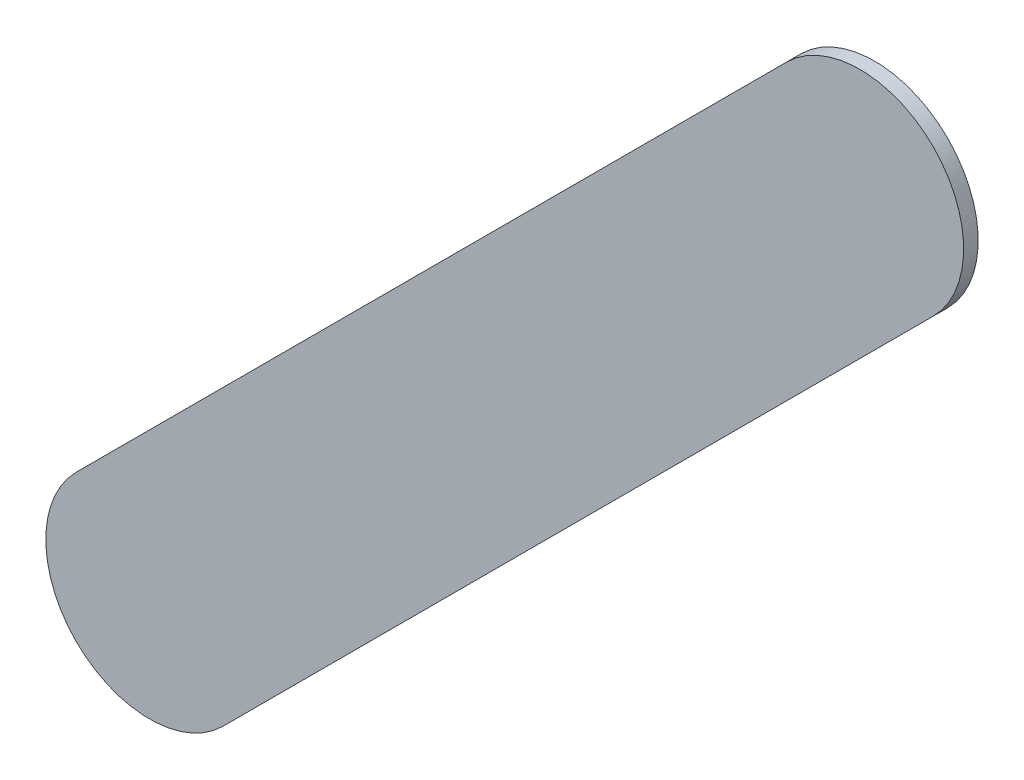
ISO-10303-21;
HEADER;
FILE_DESCRIPTION(('STEP AP214'),'2;1');
FILE_NAME('part.step','',(''),(''),'','','');
FILE_SCHEMA(('AUTOMOTIVE_DESIGN { 1 0 10303 214 1 1 1 1 }'));
ENDSEC;
DATA;
#1=APPLICATION_CONTEXT('core data for automotive mechanical design processes');
#2=APPLICATION_PROTOCOL_DEFINITION('international standard','automotive_design',2000,#1);
#3=PRODUCT_CONTEXT('',#1,'mechanical');
#4=PRODUCT('Part','Part','',(#3));
#5=PRODUCT_RELATED_PRODUCT_CATEGORY('part','',(#4));
#6=PRODUCT_DEFINITION_FORMATION('','',#4);
#7=PRODUCT_DEFINITION_CONTEXT('part definition',#1,'design');
#8=PRODUCT_DEFINITION('design','',#6,#7);
#9=PRODUCT_DEFINITION_SHAPE('','',#8);
#10=(LENGTH_UNIT() NAMED_UNIT(*) SI_UNIT(.MILLI.,.METRE.));
#11=(NAMED_UNIT(*) PLANE_ANGLE_UNIT() SI_UNIT($,.RADIAN.));
#12=(NAMED_UNIT(*) SI_UNIT($,.STERADIAN.) SOLID_ANGLE_UNIT());
#13=UNCERTAINTY_MEASURE_WITH_UNIT(LENGTH_MEASURE(1.E-05),#10,'distance_accuracy_value','');
#14=(GEOMETRIC_REPRESENTATION_CONTEXT(3) GLOBAL_UNCERTAINTY_ASSIGNED_CONTEXT((#13)) GLOBAL_UNIT_ASSIGNED_CONTEXT((#10,
#11,#12)) REPRESENTATION_CONTEXT('',''));
#15=CARTESIAN_POINT('',(0.,0.,0.));
#16=DIRECTION('',(0.,0.,1.));
#17=DIRECTION('',(1.,0.,0.));
#18=AXIS2_PLACEMENT_3D('',#15,#16,#17);
#19=CARTESIAN_POINT('',(129.528776,-109.076776,0.));
#20=DIRECTION('',(0.,0.,1.));
#21=DIRECTION('',(1.,0.,0.));
#22=AXIS2_PLACEMENT_3D('',#19,#20,#21);
#23=PLANE('',#22);
#24=DIRECTION('',(0.707106781186548,0.707106781186548,0.));
#25=VECTOR('',#24,1.);
#26=CARTESIAN_POINT('',(129.528776,-109.076776,0.));
#27=LINE('',#26,#25);
#28=CARTESIAN_POINT('',(129.528776,-109.076776,0.));
#29=VERTEX_POINT('',#28);
#30=CARTESIAN_POINT('',(131.240776,-107.364776,0.));
#31=VERTEX_POINT('',#30);
#32=EDGE_CURVE('E80',#29,#31,#27,.T.);
#33=ORIENTED_EDGE('',*,*,#32,.T.);
#34=CARTESIAN_POINT('',(131.0639995,-107.1879995,0.));
#35=DIRECTION('',(0.,0.,1.));
#36=DIRECTION('',(0.707106781186548,-0.707106781186548,0.));
#37=AXIS2_PLACEMENT_3D('',#34,#35,#36);
#38=CIRCLE('',#37,0.249999723809);
#39=CARTESIAN_POINT('',(130.887223,-107.011223,0.));
#40=VERTEX_POINT('',#39);
#41=EDGE_CURVE('E97',#31,#40,#38,.T.);
#42=ORIENTED_EDGE('',*,*,#41,.T.);
#43=DIRECTION('',(-0.707106781186548,-0.707106781186548,0.));
#44=VECTOR('',#43,1.);
#45=CARTESIAN_POINT('',(130.887223,-107.011223,0.));
#46=LINE('',#45,#44);
#47=CARTESIAN_POINT('',(129.175223,-108.723223,0.));
#48=VERTEX_POINT('',#47);
#49=EDGE_CURVE('E20',#40,#48,#46,.T.);
#50=ORIENTED_EDGE('',*,*,#49,.T.);
#51=CARTESIAN_POINT('',(129.3519995,-108.8999995,0.));
#52=DIRECTION('',(0.,0.,1.));
#53=DIRECTION('',(-0.707106781186548,0.707106781186548,0.));
#54=AXIS2_PLACEMENT_3D('',#51,#52,#53);
#55=CIRCLE('',#54,0.249999723809);
#56=EDGE_CURVE('E11',#48,#29,#55,.T.);
#57=ORIENTED_EDGE('',*,*,#56,.T.);
#58=EDGE_LOOP('',(#33,#42,#50,#57));
#59=FACE_BOUND('',#58,.T.);
#60=ADVANCED_FACE('F17',(#59),#23,.T.);
#61=CARTESIAN_POINT('',(129.528776,-109.076776,-0.035));
#62=DIRECTION('',(0.,0.,1.));
#63=DIRECTION('',(1.,0.,0.));
#64=AXIS2_PLACEMENT_3D('',#61,#62,#63);
#65=PLANE('',#64);
#66=CARTESIAN_POINT('',(129.3519995,-108.8999995,-0.035));
#67=DIRECTION('',(0.,0.,1.));
#68=DIRECTION('',(-0.707106781186548,0.707106781186548,0.));
#69=AXIS2_PLACEMENT_3D('',#66,#67,#68);
#70=CIRCLE('',#69,0.249999723809);
#71=CARTESIAN_POINT('',(129.175223,-108.723223,-0.035));
#72=VERTEX_POINT('',#71);
#73=CARTESIAN_POINT('',(129.528776,-109.076776,-0.035));
#74=VERTEX_POINT('',#73);
#75=EDGE_CURVE('E27',#72,#74,#70,.T.);
#76=ORIENTED_EDGE('',*,*,#75,.F.);
#77=DIRECTION('',(-0.707106781186548,-0.707106781186548,0.));
#78=VECTOR('',#77,1.);
#79=CARTESIAN_POINT('',(130.887223,-107.011223,-0.035));
#80=LINE('',#79,#78);
#81=CARTESIAN_POINT('',(130.887223,-107.011223,-0.035));
#82=VERTEX_POINT('',#81);
#83=EDGE_CURVE('E106',#82,#72,#80,.T.);
#84=ORIENTED_EDGE('',*,*,#83,.F.);
#85=CARTESIAN_POINT('',(131.0639995,-107.1879995,-0.035));
#86=DIRECTION('',(0.,0.,1.));
#87=DIRECTION('',(0.707106781186548,-0.707106781186548,0.));
#88=AXIS2_PLACEMENT_3D('',#85,#86,#87);
#89=CIRCLE('',#88,0.249999723809);
#90=CARTESIAN_POINT('',(131.240776,-107.364776,-0.035));
#91=VERTEX_POINT('',#90);
#92=EDGE_CURVE('E82',#91,#82,#89,.T.);
#93=ORIENTED_EDGE('',*,*,#92,.F.);
#94=DIRECTION('',(0.707106781186548,0.707106781186548,0.));
#95=VECTOR('',#94,1.);
#96=CARTESIAN_POINT('',(129.528776,-109.076776,-0.035));
#97=LINE('',#96,#95);
#98=EDGE_CURVE('E78',#74,#91,#97,.T.);
#99=ORIENTED_EDGE('',*,*,#98,.F.);
#100=EDGE_LOOP('',(#76,#84,#93,#99));
#101=FACE_BOUND('',#100,.T.);
#102=ADVANCED_FACE('F84',(#101),#65,.F.);
#103=CARTESIAN_POINT('',(129.3519995,-108.8999995,-0.035));
#104=DIRECTION('',(0.,0.,-1.));
#105=DIRECTION('',(-0.707106781186548,0.707106781186548,0.));
#106=AXIS2_PLACEMENT_3D('',#103,#104,#105);
#107=CYLINDRICAL_SURFACE('',#106,0.249999723809);
#108=ORIENTED_EDGE('',*,*,#75,.T.);
#109=DIRECTION('',(0.,0.,1.));
#110=VECTOR('',#109,1.);
#111=CARTESIAN_POINT('',(129.528776,-109.076776,-0.035));
#112=LINE('',#111,#110);
#113=EDGE_CURVE('E66',#74,#29,#112,.T.);
#114=ORIENTED_EDGE('',*,*,#113,.T.);
#115=ORIENTED_EDGE('',*,*,#56,.F.);
#116=DIRECTION('',(0.,0.,1.));
#117=VECTOR('',#116,1.);
#118=CARTESIAN_POINT('',(129.175223,-108.723223,-0.035));
#119=LINE('',#118,#117);
#120=EDGE_CURVE('E69',#72,#48,#119,.T.);
#121=ORIENTED_EDGE('',*,*,#120,.F.);
#122=EDGE_LOOP('',(#108,#114,#115,#121));
#123=FACE_BOUND('',#122,.T.);
#124=ADVANCED_FACE('F65',(#123),#107,.T.);
#125=CARTESIAN_POINT('',(130.887223,-107.011223,-0.035));
#126=DIRECTION('',(0.707106781186548,-0.707106781186548,0.));
#127=DIRECTION('',(0.,0.,-1.));
#128=AXIS2_PLACEMENT_3D('',#125,#126,#127);
#129=PLANE('',#128);
#130=ORIENTED_EDGE('',*,*,#83,.T.);
#131=ORIENTED_EDGE('',*,*,#120,.T.);
#132=ORIENTED_EDGE('',*,*,#49,.F.);
#133=DIRECTION('',(0.,0.,1.));
#134=VECTOR('',#133,1.);
#135=CARTESIAN_POINT('',(130.887223,-107.011223,-0.035));
#136=LINE('',#135,#134);
#137=EDGE_CURVE('E99',#82,#40,#136,.T.);
#138=ORIENTED_EDGE('',*,*,#137,.F.);
#139=EDGE_LOOP('',(#130,#131,#132,#138));
#140=FACE_BOUND('',#139,.T.);
#141=ADVANCED_FACE('F119',(#140),#129,.F.);
#142=CARTESIAN_POINT('',(131.0639995,-107.1879995,-0.035));
#143=DIRECTION('',(0.,0.,-1.));
#144=DIRECTION('',(0.707106781186548,-0.707106781186548,0.));
#145=AXIS2_PLACEMENT_3D('',#142,#143,#144);
#146=CYLINDRICAL_SURFACE('',#145,0.249999723809);
#147=ORIENTED_EDGE('',*,*,#92,.T.);
#148=ORIENTED_EDGE('',*,*,#137,.T.);
#149=ORIENTED_EDGE('',*,*,#41,.F.);
#150=DIRECTION('',(0.,0.,1.));
#151=VECTOR('',#150,1.);
#152=CARTESIAN_POINT('',(131.240776,-107.364776,-0.035));
#153=LINE('',#152,#151);
#154=EDGE_CURVE('E88',#91,#31,#153,.T.);
#155=ORIENTED_EDGE('',*,*,#154,.F.);
#156=EDGE_LOOP('',(#147,#148,#149,#155));
#157=FACE_BOUND('',#156,.T.);
#158=ADVANCED_FACE('F121',(#157),#146,.T.);
#159=CARTESIAN_POINT('',(129.528776,-109.076776,-0.035));
#160=DIRECTION('',(-0.707106781186548,0.707106781186548,0.));
#161=DIRECTION('',(0.,0.,1.));
#162=AXIS2_PLACEMENT_3D('',#159,#160,#161);
#163=PLANE('',#162);
#164=ORIENTED_EDGE('',*,*,#98,.T.);
#165=ORIENTED_EDGE('',*,*,#154,.T.);
#166=ORIENTED_EDGE('',*,*,#32,.F.);
#167=ORIENTED_EDGE('',*,*,#113,.F.);
#168=EDGE_LOOP('',(#164,#165,#166,#167));
#169=FACE_BOUND('',#168,.T.);
#170=ADVANCED_FACE('F76',(#169),#163,.F.);
#171=CLOSED_SHELL('',(#60,#102,#124,#141,#158,#170));
#172=MANIFOLD_SOLID_BREP('B1',#171);
#173=ADVANCED_BREP_SHAPE_REPRESENTATION('',(#18,#172),#14);
#174=SHAPE_DEFINITION_REPRESENTATION(#9,#173);
ENDSEC;
END-ISO-10303-21;
